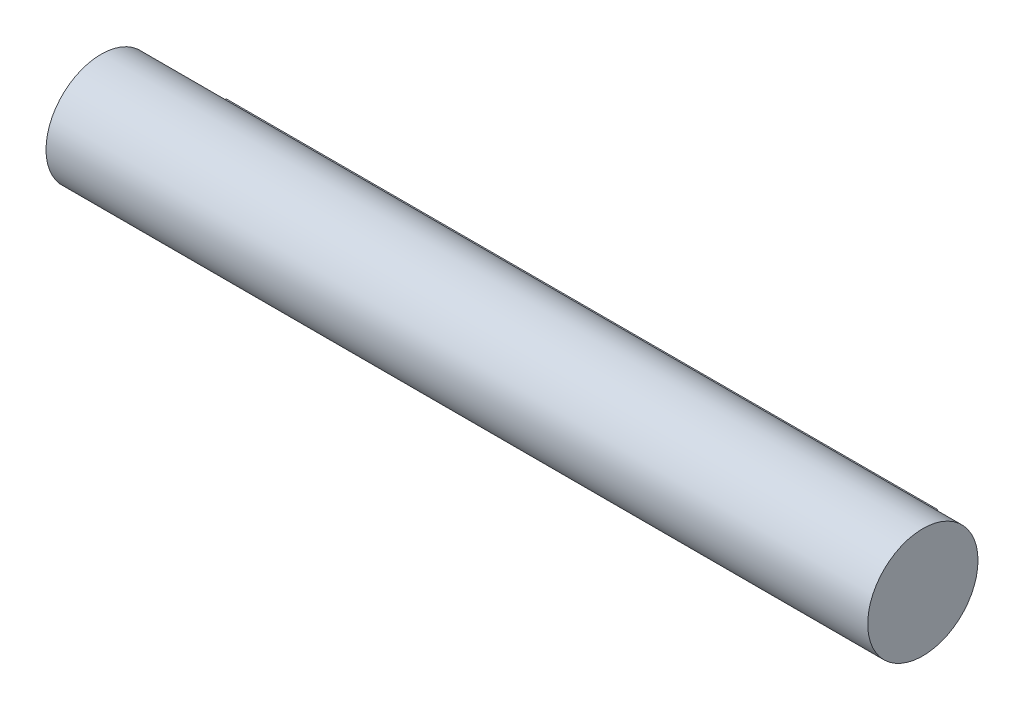
ISO-10303-21;
HEADER;
FILE_DESCRIPTION(('STEP AP214'),'2;1');
FILE_NAME('part.step','',(''),(''),'','','');
FILE_SCHEMA(('AUTOMOTIVE_DESIGN { 1 0 10303 214 1 1 1 1 }'));
ENDSEC;
DATA;
#1=APPLICATION_CONTEXT('core data for automotive mechanical design processes');
#2=APPLICATION_PROTOCOL_DEFINITION('international standard','automotive_design',2000,#1);
#3=PRODUCT_CONTEXT('',#1,'mechanical');
#4=PRODUCT('Part','Part','',(#3));
#5=PRODUCT_RELATED_PRODUCT_CATEGORY('part','',(#4));
#6=PRODUCT_DEFINITION_FORMATION('','',#4);
#7=PRODUCT_DEFINITION_CONTEXT('part definition',#1,'design');
#8=PRODUCT_DEFINITION('design','',#6,#7);
#9=PRODUCT_DEFINITION_SHAPE('','',#8);
#10=(LENGTH_UNIT() NAMED_UNIT(*) SI_UNIT(.MILLI.,.METRE.));
#11=(NAMED_UNIT(*) PLANE_ANGLE_UNIT() SI_UNIT($,.RADIAN.));
#12=(NAMED_UNIT(*) SI_UNIT($,.STERADIAN.) SOLID_ANGLE_UNIT());
#13=UNCERTAINTY_MEASURE_WITH_UNIT(LENGTH_MEASURE(1.E-05),#10,'distance_accuracy_value','');
#14=(GEOMETRIC_REPRESENTATION_CONTEXT(3) GLOBAL_UNCERTAINTY_ASSIGNED_CONTEXT((#13)) GLOBAL_UNIT_ASSIGNED_CONTEXT((#10,
#11,#12)) REPRESENTATION_CONTEXT('',''));
#15=CARTESIAN_POINT('',(0.,0.,0.));
#16=DIRECTION('',(0.,0.,1.));
#17=DIRECTION('',(1.,0.,0.));
#18=AXIS2_PLACEMENT_3D('',#15,#16,#17);
#19=CARTESIAN_POINT('',(-491.49,0.,0.));
#20=DIRECTION('',(1.,0.,0.));
#21=DIRECTION('',(0.,0.,-1.));
#22=AXIS2_PLACEMENT_3D('',#19,#20,#21);
#23=PLANE('',#22);
#24=CARTESIAN_POINT('',(-491.49,0.,0.));
#25=DIRECTION('',(-1.,0.,0.));
#26=DIRECTION('',(0.,0.,1.));
#27=AXIS2_PLACEMENT_3D('',#24,#25,#26);
#28=CIRCLE('',#27,38.1);
#29=CARTESIAN_POINT('',(-491.49,6.35,-37.5671066226826));
#30=VERTEX_POINT('',#29);
#31=CARTESIAN_POINT('',(-491.49,-6.35,-37.5671066226826));
#32=VERTEX_POINT('',#31);
#33=EDGE_CURVE('E90',#30,#32,#28,.T.);
#34=ORIENTED_EDGE('',*,*,#33,.F.);
#35=DIRECTION('',(0.,0.,-1.));
#36=VECTOR('',#35,1.);
#37=CARTESIAN_POINT('',(-491.49,6.35,0.));
#38=LINE('',#37,#36);
#39=CARTESIAN_POINT('',(-491.49,6.35,-48.26));
#40=VERTEX_POINT('',#39);
#41=EDGE_CURVE('E64',#30,#40,#38,.T.);
#42=ORIENTED_EDGE('',*,*,#41,.T.);
#43=DIRECTION('',(0.,1.,0.));
#44=VECTOR('',#43,1.);
#45=CARTESIAN_POINT('',(-491.49,0.,-48.26));
#46=LINE('',#45,#44);
#47=CARTESIAN_POINT('',(-491.49,-6.35,-48.26));
#48=VERTEX_POINT('',#47);
#49=EDGE_CURVE('E108',#48,#40,#46,.T.);
#50=ORIENTED_EDGE('',*,*,#49,.F.);
#51=DIRECTION('',(0.,0.,-1.));
#52=VECTOR('',#51,1.);
#53=CARTESIAN_POINT('',(-491.49,-6.35,0.));
#54=LINE('',#53,#52);
#55=EDGE_CURVE('E97',#32,#48,#54,.T.);
#56=ORIENTED_EDGE('',*,*,#55,.F.);
#57=EDGE_LOOP('',(#34,#42,#50,#56));
#58=FACE_BOUND('',#57,.T.);
#59=ADVANCED_FACE('F44',(#58),#23,.F.);
#60=CARTESIAN_POINT('',(-491.49,0.,0.));
#61=DIRECTION('',(1.,0.,0.));
#62=DIRECTION('',(0.,0.,-1.));
#63=AXIS2_PLACEMENT_3D('',#60,#61,#62);
#64=CYLINDRICAL_SURFACE('',#63,38.1);
#65=DIRECTION('',(1.,0.,0.));
#66=VECTOR('',#65,1.);
#67=CARTESIAN_POINT('',(-491.49,-6.35,-37.5671066226826));
#68=LINE('',#67,#66);
#69=CARTESIAN_POINT('',(0.,-6.35,-37.5671066226826));
#70=VERTEX_POINT('',#69);
#71=EDGE_CURVE('E48',#32,#70,#68,.T.);
#72=ORIENTED_EDGE('',*,*,#71,.T.);
#73=CARTESIAN_POINT('',(0.,0.,0.));
#74=DIRECTION('',(1.,0.,0.));
#75=DIRECTION('',(0.,0.,-1.));
#76=AXIS2_PLACEMENT_3D('',#73,#74,#75);
#77=CIRCLE('',#76,38.1);
#78=CARTESIAN_POINT('',(0.,6.35,-37.5671066226826));
#79=VERTEX_POINT('',#78);
#80=EDGE_CURVE('E11',#70,#79,#77,.T.);
#81=ORIENTED_EDGE('',*,*,#80,.T.);
#82=DIRECTION('',(1.,0.,0.));
#83=VECTOR('',#82,1.);
#84=CARTESIAN_POINT('',(-491.49,6.35,-37.5671066226826));
#85=LINE('',#84,#83);
#86=EDGE_CURVE('E55',#30,#79,#85,.T.);
#87=ORIENTED_EDGE('',*,*,#86,.F.);
#88=ORIENTED_EDGE('',*,*,#33,.T.);
#89=EDGE_LOOP('',(#72,#81,#87,#88));
#90=FACE_BOUND('',#89,.T.);
#91=CARTESIAN_POINT('',(38.1,0.,0.));
#92=DIRECTION('',(1.,0.,0.));
#93=DIRECTION('',(0.,0.,-1.));
#94=AXIS2_PLACEMENT_3D('',#91,#92,#93);
#95=CIRCLE('',#94,38.1);
#96=CARTESIAN_POINT('',(38.1,0.,-38.1));
#97=VERTEX_POINT('',#96);
#98=EDGE_CURVE('E120',#97,#97,#95,.T.);
#99=ORIENTED_EDGE('',*,*,#98,.F.);
#100=EDGE_LOOP('',(#99));
#101=FACE_BOUND('',#100,.T.);
#102=CARTESIAN_POINT('',(-529.59,0.,0.));
#103=DIRECTION('',(-1.,0.,0.));
#104=DIRECTION('',(0.,0.,1.));
#105=AXIS2_PLACEMENT_3D('',#102,#103,#104);
#106=CIRCLE('',#105,38.1);
#107=CARTESIAN_POINT('',(-529.59,0.,38.1));
#108=VERTEX_POINT('',#107);
#109=EDGE_CURVE('E99',#108,#108,#106,.T.);
#110=ORIENTED_EDGE('',*,*,#109,.F.);
#111=EDGE_LOOP('',(#110));
#112=FACE_BOUND('',#111,.T.);
#113=ADVANCED_FACE('F46',(#90,#101,#112),#64,.T.);
#114=CARTESIAN_POINT('',(-491.49,6.35,0.));
#115=DIRECTION('',(0.,-1.,0.));
#116=DIRECTION('',(0.,0.,-1.));
#117=AXIS2_PLACEMENT_3D('',#114,#115,#116);
#118=PLANE('',#117);
#119=DIRECTION('',(0.,0.,-1.));
#120=VECTOR('',#119,1.);
#121=CARTESIAN_POINT('',(0.,6.35,0.));
#122=LINE('',#121,#120);
#123=CARTESIAN_POINT('',(0.,6.35,-48.26));
#124=VERTEX_POINT('',#123);
#125=EDGE_CURVE('E124',#79,#124,#122,.T.);
#126=ORIENTED_EDGE('',*,*,#125,.T.);
#127=DIRECTION('',(1.,0.,0.));
#128=VECTOR('',#127,1.);
#129=CARTESIAN_POINT('',(-491.49,6.35,-48.26));
#130=LINE('',#129,#128);
#131=EDGE_CURVE('E84',#40,#124,#130,.T.);
#132=ORIENTED_EDGE('',*,*,#131,.F.);
#133=ORIENTED_EDGE('',*,*,#41,.F.);
#134=ORIENTED_EDGE('',*,*,#86,.T.);
#135=EDGE_LOOP('',(#126,#132,#133,#134));
#136=FACE_BOUND('',#135,.T.);
#137=ADVANCED_FACE('F106',(#136),#118,.F.);
#138=CARTESIAN_POINT('',(-491.49,0.,-48.26));
#139=DIRECTION('',(0.,0.,-1.));
#140=DIRECTION('',(-1.,0.,0.));
#141=AXIS2_PLACEMENT_3D('',#138,#139,#140);
#142=PLANE('',#141);
#143=DIRECTION('',(0.,1.,0.));
#144=VECTOR('',#143,1.);
#145=CARTESIAN_POINT('',(0.,0.,-48.26));
#146=LINE('',#145,#144);
#147=CARTESIAN_POINT('',(0.,-6.35,-48.26));
#148=VERTEX_POINT('',#147);
#149=EDGE_CURVE('E119',#148,#124,#146,.T.);
#150=ORIENTED_EDGE('',*,*,#149,.F.);
#151=DIRECTION('',(1.,0.,0.));
#152=VECTOR('',#151,1.);
#153=CARTESIAN_POINT('',(-491.49,-6.35,-48.26));
#154=LINE('',#153,#152);
#155=EDGE_CURVE('E79',#48,#148,#154,.T.);
#156=ORIENTED_EDGE('',*,*,#155,.F.);
#157=ORIENTED_EDGE('',*,*,#49,.T.);
#158=ORIENTED_EDGE('',*,*,#131,.T.);
#159=EDGE_LOOP('',(#150,#156,#157,#158));
#160=FACE_BOUND('',#159,.T.);
#161=ADVANCED_FACE('F145',(#160),#142,.T.);
#162=CARTESIAN_POINT('',(-491.49,-6.35,0.));
#163=DIRECTION('',(0.,-1.,0.));
#164=DIRECTION('',(0.,0.,-1.));
#165=AXIS2_PLACEMENT_3D('',#162,#163,#164);
#166=PLANE('',#165);
#167=DIRECTION('',(0.,0.,-1.));
#168=VECTOR('',#167,1.);
#169=CARTESIAN_POINT('',(0.,-6.35,0.));
#170=LINE('',#169,#168);
#171=EDGE_CURVE('E115',#70,#148,#170,.T.);
#172=ORIENTED_EDGE('',*,*,#171,.F.);
#173=ORIENTED_EDGE('',*,*,#71,.F.);
#174=ORIENTED_EDGE('',*,*,#55,.T.);
#175=ORIENTED_EDGE('',*,*,#155,.T.);
#176=EDGE_LOOP('',(#172,#173,#174,#175));
#177=FACE_BOUND('',#176,.T.);
#178=ADVANCED_FACE('F156',(#177),#166,.T.);
#179=CARTESIAN_POINT('',(0.,0.,0.));
#180=DIRECTION('',(1.,0.,0.));
#181=DIRECTION('',(0.,0.,-1.));
#182=AXIS2_PLACEMENT_3D('',#179,#180,#181);
#183=PLANE('',#182);
#184=ORIENTED_EDGE('',*,*,#80,.F.);
#185=ORIENTED_EDGE('',*,*,#171,.T.);
#186=ORIENTED_EDGE('',*,*,#149,.T.);
#187=ORIENTED_EDGE('',*,*,#125,.F.);
#188=EDGE_LOOP('',(#184,#185,#186,#187));
#189=FACE_BOUND('',#188,.T.);
#190=ADVANCED_FACE('F154',(#189),#183,.T.);
#191=CARTESIAN_POINT('',(38.1,0.,0.));
#192=DIRECTION('',(1.,0.,0.));
#193=DIRECTION('',(0.,0.,-1.));
#194=AXIS2_PLACEMENT_3D('',#191,#192,#193);
#195=PLANE('',#194);
#196=ORIENTED_EDGE('',*,*,#98,.T.);
#197=EDGE_LOOP('',(#196));
#198=FACE_BOUND('',#197,.T.);
#199=ADVANCED_FACE('F152',(#198),#195,.T.);
#200=CARTESIAN_POINT('',(-529.59,0.,0.));
#201=DIRECTION('',(-1.,0.,0.));
#202=DIRECTION('',(0.,0.,1.));
#203=AXIS2_PLACEMENT_3D('',#200,#201,#202);
#204=PLANE('',#203);
#205=ORIENTED_EDGE('',*,*,#109,.T.);
#206=EDGE_LOOP('',(#205));
#207=FACE_BOUND('',#206,.T.);
#208=ADVANCED_FACE('F138',(#207),#204,.T.);
#209=CLOSED_SHELL('',(#59,#113,#137,#161,#178,#190,#199,#208));
#210=MANIFOLD_SOLID_BREP('B2',#209);
#211=ADVANCED_BREP_SHAPE_REPRESENTATION('',(#18,#210),#14);
#212=SHAPE_DEFINITION_REPRESENTATION(#9,#211);
ENDSEC;
END-ISO-10303-21;
